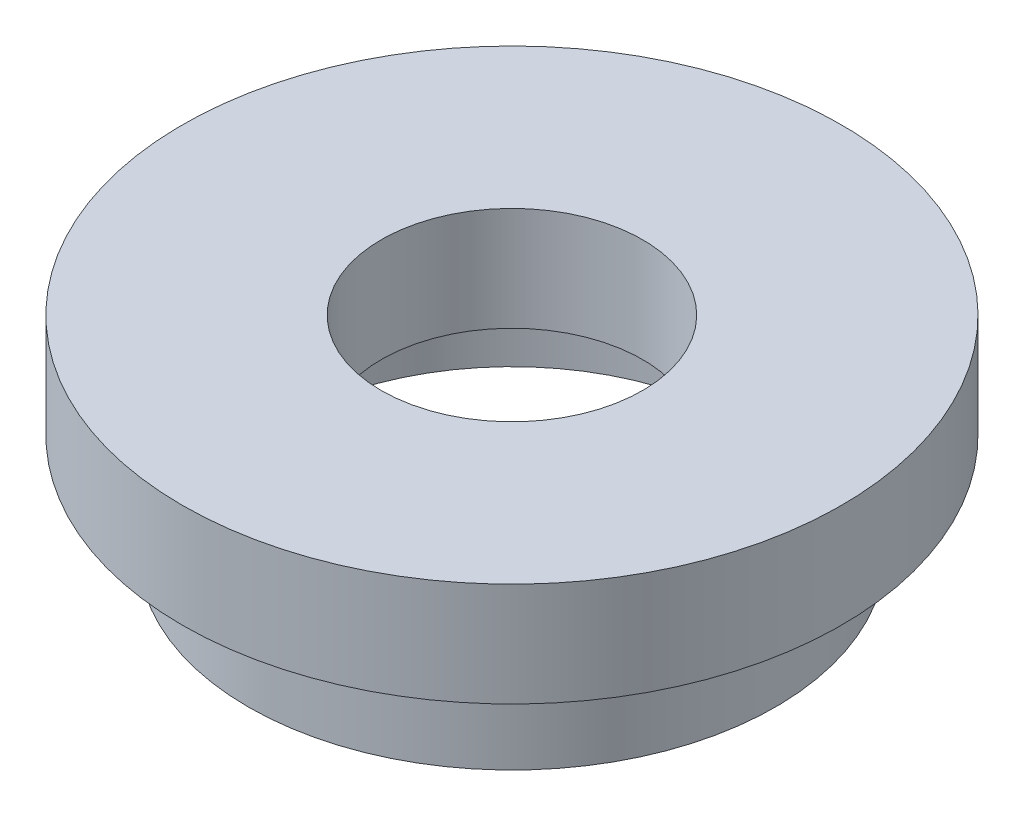
ISO-10303-21;
HEADER;
FILE_DESCRIPTION(('STEP AP214'),'2;1');
FILE_NAME('part.step','',(''),(''),'','','');
FILE_SCHEMA(('AUTOMOTIVE_DESIGN { 1 0 10303 214 1 1 1 1 }'));
ENDSEC;
DATA;
#1=APPLICATION_CONTEXT('core data for automotive mechanical design processes');
#2=APPLICATION_PROTOCOL_DEFINITION('international standard','automotive_design',2000,#1);
#3=PRODUCT_CONTEXT('',#1,'mechanical');
#4=PRODUCT('Part','Part','',(#3));
#5=PRODUCT_RELATED_PRODUCT_CATEGORY('part','',(#4));
#6=PRODUCT_DEFINITION_FORMATION('','',#4);
#7=PRODUCT_DEFINITION_CONTEXT('part definition',#1,'design');
#8=PRODUCT_DEFINITION('design','',#6,#7);
#9=PRODUCT_DEFINITION_SHAPE('','',#8);
#10=(LENGTH_UNIT() NAMED_UNIT(*) SI_UNIT(.MILLI.,.METRE.));
#11=(NAMED_UNIT(*) PLANE_ANGLE_UNIT() SI_UNIT($,.RADIAN.));
#12=(NAMED_UNIT(*) SI_UNIT($,.STERADIAN.) SOLID_ANGLE_UNIT());
#13=UNCERTAINTY_MEASURE_WITH_UNIT(LENGTH_MEASURE(1.E-05),#10,'distance_accuracy_value','');
#14=(GEOMETRIC_REPRESENTATION_CONTEXT(3) GLOBAL_UNCERTAINTY_ASSIGNED_CONTEXT((#13)) GLOBAL_UNIT_ASSIGNED_CONTEXT((#10,
#11,#12)) REPRESENTATION_CONTEXT('',''));
#15=CARTESIAN_POINT('',(0.,0.,0.));
#16=DIRECTION('',(0.,0.,1.));
#17=DIRECTION('',(1.,0.,0.));
#18=AXIS2_PLACEMENT_3D('',#15,#16,#17);
#19=CARTESIAN_POINT('',(0.,13.7446808510638,0.));
#20=DIRECTION('',(0.,1.,0.));
#21=DIRECTION('',(0.,0.,1.));
#22=AXIS2_PLACEMENT_3D('',#19,#20,#21);
#23=CYLINDRICAL_SURFACE('',#22,11.1);
#24=CARTESIAN_POINT('',(0.,0.,0.));
#25=DIRECTION('',(0.,1.,0.));
#26=DIRECTION('',(0.,0.,1.));
#27=AXIS2_PLACEMENT_3D('',#24,#25,#26);
#28=CIRCLE('',#27,11.1);
#29=CARTESIAN_POINT('',(0.,0.,11.1));
#30=VERTEX_POINT('',#29);
#31=EDGE_CURVE('E75',#30,#30,#28,.T.);
#32=ORIENTED_EDGE('',*,*,#31,.F.);
#33=EDGE_LOOP('',(#32));
#34=FACE_BOUND('',#33,.T.);
#35=CARTESIAN_POINT('',(0.,4.,0.));
#36=DIRECTION('',(0.,1.,0.));
#37=DIRECTION('',(0.,0.,1.));
#38=AXIS2_PLACEMENT_3D('',#35,#36,#37);
#39=CIRCLE('',#38,11.1);
#40=CARTESIAN_POINT('',(0.,4.,11.1));
#41=VERTEX_POINT('',#40);
#42=EDGE_CURVE('E10',#41,#41,#39,.T.);
#43=ORIENTED_EDGE('',*,*,#42,.T.);
#44=EDGE_LOOP('',(#43));
#45=FACE_BOUND('',#44,.T.);
#46=ADVANCED_FACE('F35',(#34,#45),#23,.F.);
#47=CARTESIAN_POINT('',(11.1,4.,0.));
#48=DIRECTION('',(0.,-1.,0.));
#49=DIRECTION('',(0.,0.,-1.));
#50=AXIS2_PLACEMENT_3D('',#47,#48,#49);
#51=PLANE('',#50);
#52=ORIENTED_EDGE('',*,*,#42,.F.);
#53=EDGE_LOOP('',(#52));
#54=FACE_BOUND('',#53,.T.);
#55=CARTESIAN_POINT('',(0.,4.,0.));
#56=DIRECTION('',(0.,1.,0.));
#57=DIRECTION('',(0.,0.,1.));
#58=AXIS2_PLACEMENT_3D('',#55,#56,#57);
#59=CIRCLE('',#58,11.7);
#60=CARTESIAN_POINT('',(0.,4.,11.7));
#61=VERTEX_POINT('',#60);
#62=EDGE_CURVE('E41',#61,#61,#59,.T.);
#63=ORIENTED_EDGE('',*,*,#62,.T.);
#64=EDGE_LOOP('',(#63));
#65=FACE_BOUND('',#64,.T.);
#66=ADVANCED_FACE('F82',(#54,#65),#51,.F.);
#67=CARTESIAN_POINT('',(0.,13.7446808510638,0.));
#68=DIRECTION('',(0.,1.,0.));
#69=DIRECTION('',(0.,0.,1.));
#70=AXIS2_PLACEMENT_3D('',#67,#68,#69);
#71=CYLINDRICAL_SURFACE('',#70,11.7);
#72=ORIENTED_EDGE('',*,*,#62,.F.);
#73=EDGE_LOOP('',(#72));
#74=FACE_BOUND('',#73,.T.);
#75=CARTESIAN_POINT('',(0.,5.,0.));
#76=DIRECTION('',(0.,1.,0.));
#77=DIRECTION('',(0.,0.,1.));
#78=AXIS2_PLACEMENT_3D('',#75,#76,#77);
#79=CIRCLE('',#78,11.7);
#80=CARTESIAN_POINT('',(0.,5.,11.7));
#81=VERTEX_POINT('',#80);
#82=EDGE_CURVE('E45',#81,#81,#79,.T.);
#83=ORIENTED_EDGE('',*,*,#82,.T.);
#84=EDGE_LOOP('',(#83));
#85=FACE_BOUND('',#84,.T.);
#86=ADVANCED_FACE('F86',(#74,#85),#71,.F.);
#87=CARTESIAN_POINT('',(11.7,5.,0.));
#88=DIRECTION('',(0.,1.,0.));
#89=DIRECTION('',(0.,0.,1.));
#90=AXIS2_PLACEMENT_3D('',#87,#88,#89);
#91=PLANE('',#90);
#92=ORIENTED_EDGE('',*,*,#82,.F.);
#93=EDGE_LOOP('',(#92));
#94=FACE_BOUND('',#93,.T.);
#95=CARTESIAN_POINT('',(0.,5.,0.));
#96=DIRECTION('',(0.,1.,0.));
#97=DIRECTION('',(0.,0.,1.));
#98=AXIS2_PLACEMENT_3D('',#95,#96,#97);
#99=CIRCLE('',#98,6.295);
#100=CARTESIAN_POINT('',(0.,5.,6.295));
#101=VERTEX_POINT('',#100);
#102=EDGE_CURVE('E49',#101,#101,#99,.T.);
#103=ORIENTED_EDGE('',*,*,#102,.T.);
#104=EDGE_LOOP('',(#103));
#105=FACE_BOUND('',#104,.T.);
#106=ADVANCED_FACE('F91',(#94,#105),#91,.F.);
#107=CARTESIAN_POINT('',(0.,13.7446808510638,0.));
#108=DIRECTION('',(0.,1.,0.));
#109=DIRECTION('',(0.,0.,1.));
#110=AXIS2_PLACEMENT_3D('',#107,#108,#109);
#111=CYLINDRICAL_SURFACE('',#110,6.295);
#112=ORIENTED_EDGE('',*,*,#102,.F.);
#113=EDGE_LOOP('',(#112));
#114=FACE_BOUND('',#113,.T.);
#115=CARTESIAN_POINT('',(0.,10.,0.));
#116=DIRECTION('',(0.,1.,0.));
#117=DIRECTION('',(0.,0.,1.));
#118=AXIS2_PLACEMENT_3D('',#115,#116,#117);
#119=CIRCLE('',#118,6.295);
#120=CARTESIAN_POINT('',(0.,10.,6.295));
#121=VERTEX_POINT('',#120);
#122=EDGE_CURVE('E54',#121,#121,#119,.T.);
#123=ORIENTED_EDGE('',*,*,#122,.T.);
#124=EDGE_LOOP('',(#123));
#125=FACE_BOUND('',#124,.T.);
#126=ADVANCED_FACE('F97',(#114,#125),#111,.F.);
#127=CARTESIAN_POINT('',(6.295,10.,0.));
#128=DIRECTION('',(0.,-1.,0.));
#129=DIRECTION('',(0.,0.,-1.));
#130=AXIS2_PLACEMENT_3D('',#127,#128,#129);
#131=PLANE('',#130);
#132=ORIENTED_EDGE('',*,*,#122,.F.);
#133=EDGE_LOOP('',(#132));
#134=FACE_BOUND('',#133,.T.);
#135=CARTESIAN_POINT('',(0.,10.,0.));
#136=DIRECTION('',(0.,1.,0.));
#137=DIRECTION('',(0.,0.,1.));
#138=AXIS2_PLACEMENT_3D('',#135,#136,#137);
#139=CIRCLE('',#138,15.875);
#140=CARTESIAN_POINT('',(0.,10.,15.875));
#141=VERTEX_POINT('',#140);
#142=EDGE_CURVE('E57',#141,#141,#139,.T.);
#143=ORIENTED_EDGE('',*,*,#142,.T.);
#144=EDGE_LOOP('',(#143));
#145=FACE_BOUND('',#144,.T.);
#146=ADVANCED_FACE('F101',(#134,#145),#131,.F.);
#147=CARTESIAN_POINT('',(0.,13.7446808510638,0.));
#148=DIRECTION('',(0.,1.,0.));
#149=DIRECTION('',(0.,0.,1.));
#150=AXIS2_PLACEMENT_3D('',#147,#148,#149);
#151=CYLINDRICAL_SURFACE('',#150,15.875);
#152=ORIENTED_EDGE('',*,*,#142,.F.);
#153=EDGE_LOOP('',(#152));
#154=FACE_BOUND('',#153,.T.);
#155=CARTESIAN_POINT('',(0.,5.,0.));
#156=DIRECTION('',(0.,1.,0.));
#157=DIRECTION('',(0.,0.,1.));
#158=AXIS2_PLACEMENT_3D('',#155,#156,#157);
#159=CIRCLE('',#158,15.875);
#160=CARTESIAN_POINT('',(0.,5.,15.875));
#161=VERTEX_POINT('',#160);
#162=EDGE_CURVE('E60',#161,#161,#159,.T.);
#163=ORIENTED_EDGE('',*,*,#162,.T.);
#164=EDGE_LOOP('',(#163));
#165=FACE_BOUND('',#164,.T.);
#166=ADVANCED_FACE('F105',(#154,#165),#151,.T.);
#167=CARTESIAN_POINT('',(15.875,5.,0.));
#168=DIRECTION('',(0.,1.,0.));
#169=DIRECTION('',(0.,0.,1.));
#170=AXIS2_PLACEMENT_3D('',#167,#168,#169);
#171=PLANE('',#170);
#172=ORIENTED_EDGE('',*,*,#162,.F.);
#173=EDGE_LOOP('',(#172));
#174=FACE_BOUND('',#173,.T.);
#175=CARTESIAN_POINT('',(0.,5.,0.));
#176=DIRECTION('',(0.,1.,0.));
#177=DIRECTION('',(0.,0.,1.));
#178=AXIS2_PLACEMENT_3D('',#175,#176,#177);
#179=CIRCLE('',#178,12.55);
#180=CARTESIAN_POINT('',(0.,5.,12.55));
#181=VERTEX_POINT('',#180);
#182=EDGE_CURVE('E63',#181,#181,#179,.T.);
#183=ORIENTED_EDGE('',*,*,#182,.T.);
#184=EDGE_LOOP('',(#183));
#185=FACE_BOUND('',#184,.T.);
#186=ADVANCED_FACE('F109',(#174,#185),#171,.F.);
#187=CARTESIAN_POINT('',(0.,13.7446808510638,0.));
#188=DIRECTION('',(0.,1.,0.));
#189=DIRECTION('',(0.,0.,1.));
#190=AXIS2_PLACEMENT_3D('',#187,#188,#189);
#191=CYLINDRICAL_SURFACE('',#190,12.55);
#192=ORIENTED_EDGE('',*,*,#182,.F.);
#193=EDGE_LOOP('',(#192));
#194=FACE_BOUND('',#193,.T.);
#195=CARTESIAN_POINT('',(0.,4.,0.));
#196=DIRECTION('',(0.,1.,0.));
#197=DIRECTION('',(0.,0.,1.));
#198=AXIS2_PLACEMENT_3D('',#195,#196,#197);
#199=CIRCLE('',#198,12.55);
#200=CARTESIAN_POINT('',(0.,4.,12.55));
#201=VERTEX_POINT('',#200);
#202=EDGE_CURVE('E66',#201,#201,#199,.T.);
#203=ORIENTED_EDGE('',*,*,#202,.T.);
#204=EDGE_LOOP('',(#203));
#205=FACE_BOUND('',#204,.T.);
#206=ADVANCED_FACE('F113',(#194,#205),#191,.T.);
#207=CARTESIAN_POINT('',(12.55,4.,0.));
#208=DIRECTION('',(0.,-1.,0.));
#209=DIRECTION('',(0.,0.,-1.));
#210=AXIS2_PLACEMENT_3D('',#207,#208,#209);
#211=PLANE('',#210);
#212=ORIENTED_EDGE('',*,*,#202,.F.);
#213=EDGE_LOOP('',(#212));
#214=FACE_BOUND('',#213,.T.);
#215=CARTESIAN_POINT('',(0.,4.,0.));
#216=DIRECTION('',(0.,1.,0.));
#217=DIRECTION('',(0.,0.,1.));
#218=AXIS2_PLACEMENT_3D('',#215,#216,#217);
#219=CIRCLE('',#218,12.7);
#220=CARTESIAN_POINT('',(0.,4.,12.7));
#221=VERTEX_POINT('',#220);
#222=EDGE_CURVE('E69',#221,#221,#219,.T.);
#223=ORIENTED_EDGE('',*,*,#222,.T.);
#224=EDGE_LOOP('',(#223));
#225=FACE_BOUND('',#224,.T.);
#226=ADVANCED_FACE('F117',(#214,#225),#211,.F.);
#227=CARTESIAN_POINT('',(0.,13.7446808510638,0.));
#228=DIRECTION('',(0.,1.,0.));
#229=DIRECTION('',(0.,0.,1.));
#230=AXIS2_PLACEMENT_3D('',#227,#228,#229);
#231=CYLINDRICAL_SURFACE('',#230,12.7);
#232=ORIENTED_EDGE('',*,*,#222,.F.);
#233=EDGE_LOOP('',(#232));
#234=FACE_BOUND('',#233,.T.);
#235=CARTESIAN_POINT('',(0.,0.,0.));
#236=DIRECTION('',(0.,1.,0.));
#237=DIRECTION('',(0.,0.,1.));
#238=AXIS2_PLACEMENT_3D('',#235,#236,#237);
#239=CIRCLE('',#238,12.7);
#240=CARTESIAN_POINT('',(0.,0.,12.7));
#241=VERTEX_POINT('',#240);
#242=EDGE_CURVE('E72',#241,#241,#239,.T.);
#243=ORIENTED_EDGE('',*,*,#242,.T.);
#244=EDGE_LOOP('',(#243));
#245=FACE_BOUND('',#244,.T.);
#246=ADVANCED_FACE('F121',(#234,#245),#231,.T.);
#247=CARTESIAN_POINT('',(12.7,0.,0.));
#248=DIRECTION('',(0.,1.,0.));
#249=DIRECTION('',(0.,0.,1.));
#250=AXIS2_PLACEMENT_3D('',#247,#248,#249);
#251=PLANE('',#250);
#252=ORIENTED_EDGE('',*,*,#242,.F.);
#253=EDGE_LOOP('',(#252));
#254=FACE_BOUND('',#253,.T.);
#255=ORIENTED_EDGE('',*,*,#31,.T.);
#256=EDGE_LOOP('',(#255));
#257=FACE_BOUND('',#256,.T.);
#258=ADVANCED_FACE('F79',(#254,#257),#251,.F.);
#259=CLOSED_SHELL('',(#46,#66,#86,#106,#126,#146,#166,#186,#206,#226,#246,#258));
#260=MANIFOLD_SOLID_BREP('B2',#259);
#261=ADVANCED_BREP_SHAPE_REPRESENTATION('',(#18,#260),#14);
#262=SHAPE_DEFINITION_REPRESENTATION(#9,#261);
ENDSEC;
END-ISO-10303-21;
